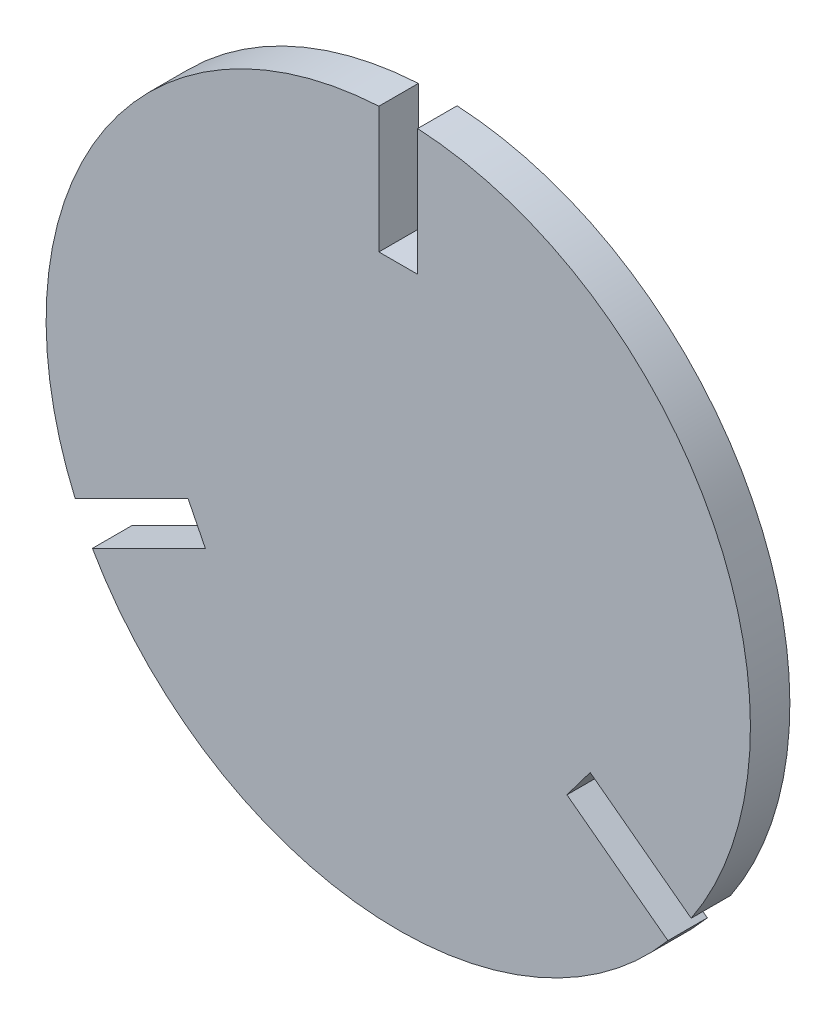
ISO-10303-21;
HEADER;
FILE_DESCRIPTION(('STEP AP214'),'2;1');
FILE_NAME('part.step','',(''),(''),'','','');
FILE_SCHEMA(('AUTOMOTIVE_DESIGN { 1 0 10303 214 1 1 1 1 }'));
ENDSEC;
DATA;
#1=APPLICATION_CONTEXT('core data for automotive mechanical design processes');
#2=APPLICATION_PROTOCOL_DEFINITION('international standard','automotive_design',2000,#1);
#3=PRODUCT_CONTEXT('',#1,'mechanical');
#4=PRODUCT('Part','Part','',(#3));
#5=PRODUCT_RELATED_PRODUCT_CATEGORY('part','',(#4));
#6=PRODUCT_DEFINITION_FORMATION('','',#4);
#7=PRODUCT_DEFINITION_CONTEXT('part definition',#1,'design');
#8=PRODUCT_DEFINITION('design','',#6,#7);
#9=PRODUCT_DEFINITION_SHAPE('','',#8);
#10=(LENGTH_UNIT() NAMED_UNIT(*) SI_UNIT(.MILLI.,.METRE.));
#11=(NAMED_UNIT(*) PLANE_ANGLE_UNIT() SI_UNIT($,.RADIAN.));
#12=(NAMED_UNIT(*) SI_UNIT($,.STERADIAN.) SOLID_ANGLE_UNIT());
#13=UNCERTAINTY_MEASURE_WITH_UNIT(LENGTH_MEASURE(1.E-05),#10,'distance_accuracy_value','');
#14=(GEOMETRIC_REPRESENTATION_CONTEXT(3) GLOBAL_UNCERTAINTY_ASSIGNED_CONTEXT((#13)) GLOBAL_UNIT_ASSIGNED_CONTEXT((#10,
#11,#12)) REPRESENTATION_CONTEXT('',''));
#15=CARTESIAN_POINT('',(0.,0.,0.));
#16=DIRECTION('',(0.,0.,1.));
#17=DIRECTION('',(1.,0.,0.));
#18=AXIS2_PLACEMENT_3D('',#15,#16,#17);
#19=CARTESIAN_POINT('',(0.,0.,2.8));
#20=DIRECTION('',(0.,0.,-1.));
#21=DIRECTION('',(-1.,0.,0.));
#22=AXIS2_PLACEMENT_3D('',#19,#20,#21);
#23=CYLINDRICAL_SURFACE('',#22,25.);
#24=DIRECTION('',(0.,0.,-1.));
#25=VECTOR('',#24,1.);
#26=CARTESIAN_POINT('',(-22.9426279770591,-9.93155685208841,2.8));
#27=LINE('',#26,#25);
#28=CARTESIAN_POINT('',(-22.9426279770591,-9.93155685208841,2.8));
#29=VERTEX_POINT('',#28);
#30=CARTESIAN_POINT('',(-22.9426279770591,-9.93155685208841,0.));
#31=VERTEX_POINT('',#30);
#32=EDGE_CURVE('E172',#29,#31,#27,.T.);
#33=ORIENTED_EDGE('',*,*,#32,.F.);
#34=CARTESIAN_POINT('',(0.,0.,2.8));
#35=DIRECTION('',(0.,0.,1.));
#36=DIRECTION('',(1.,0.,0.));
#37=AXIS2_PLACEMENT_3D('',#34,#35,#36);
#38=CIRCLE('',#37,25.);
#39=CARTESIAN_POINT('',(-1.375,24.9621588609639,2.8));
#40=VERTEX_POINT('',#39);
#41=EDGE_CURVE('E198',#40,#29,#38,.T.);
#42=ORIENTED_EDGE('',*,*,#41,.F.);
#43=DIRECTION('',(0.,0.,-1.));
#44=VECTOR('',#43,1.);
#45=CARTESIAN_POINT('',(-1.375,24.9621588609639,2.8));
#46=LINE('',#45,#44);
#47=CARTESIAN_POINT('',(-1.375,24.9621588609639,0.));
#48=VERTEX_POINT('',#47);
#49=EDGE_CURVE('E192',#48,#40,#46,.F.);
#50=ORIENTED_EDGE('',*,*,#49,.F.);
#51=CARTESIAN_POINT('',(0.,0.,0.));
#52=DIRECTION('',(0.,0.,1.));
#53=DIRECTION('',(1.,0.,0.));
#54=AXIS2_PLACEMENT_3D('',#51,#52,#53);
#55=CIRCLE('',#54,25.);
#56=EDGE_CURVE('E203',#48,#31,#55,.T.);
#57=ORIENTED_EDGE('',*,*,#56,.T.);
#58=EDGE_LOOP('',(#33,#42,#50,#57));
#59=FACE_BOUND('',#58,.T.);
#60=ADVANCED_FACE('F35',(#59),#23,.T.);
#61=DIRECTION('',(0.,0.,-1.));
#62=VECTOR('',#61,1.);
#63=CARTESIAN_POINT('',(-21.7130074383324,-12.3913400398392,2.8));
#64=LINE('',#63,#62);
#65=CARTESIAN_POINT('',(-21.7130074383324,-12.3913400398392,0.));
#66=VERTEX_POINT('',#65);
#67=CARTESIAN_POINT('',(-21.7130074383324,-12.3913400398392,2.8));
#68=VERTEX_POINT('',#67);
#69=EDGE_CURVE('E129',#66,#68,#64,.F.);
#70=ORIENTED_EDGE('',*,*,#69,.F.);
#71=CARTESIAN_POINT('',(19.1418920530605,-16.0806706523385,0.));
#72=VERTEX_POINT('',#71);
#73=EDGE_CURVE('E206',#66,#72,#55,.T.);
#74=ORIENTED_EDGE('',*,*,#73,.T.);
#75=DIRECTION('',(0.,0.,-1.));
#76=VECTOR('',#75,1.);
#77=CARTESIAN_POINT('',(19.1418920530605,-16.0806706523385,2.8));
#78=LINE('',#77,#76);
#79=CARTESIAN_POINT('',(19.1418920530605,-16.0806706523385,2.8));
#80=VERTEX_POINT('',#79);
#81=EDGE_CURVE('E169',#80,#72,#78,.T.);
#82=ORIENTED_EDGE('',*,*,#81,.F.);
#83=EDGE_CURVE('E201',#68,#80,#38,.T.);
#84=ORIENTED_EDGE('',*,*,#83,.F.);
#85=EDGE_LOOP('',(#70,#74,#82,#84));
#86=FACE_BOUND('',#85,.T.);
#87=ADVANCED_FACE('F225',(#86),#23,.T.);
#88=DIRECTION('',(0.,0.,-1.));
#89=VECTOR('',#88,1.);
#90=CARTESIAN_POINT('',(20.7922799299633,-13.880961613449,2.8));
#91=LINE('',#90,#89);
#92=CARTESIAN_POINT('',(20.7922799299633,-13.880961613449,0.));
#93=VERTEX_POINT('',#92);
#94=CARTESIAN_POINT('',(20.7922799299633,-13.880961613449,2.8));
#95=VERTEX_POINT('',#94);
#96=EDGE_CURVE('E142',#93,#95,#91,.F.);
#97=ORIENTED_EDGE('',*,*,#96,.F.);
#98=CARTESIAN_POINT('',(1.375,24.9621588609639,0.));
#99=VERTEX_POINT('',#98);
#100=EDGE_CURVE('E197',#93,#99,#55,.T.);
#101=ORIENTED_EDGE('',*,*,#100,.T.);
#102=DIRECTION('',(0.,0.,-1.));
#103=VECTOR('',#102,1.);
#104=CARTESIAN_POINT('',(1.375,24.9621588609639,2.8));
#105=LINE('',#104,#103);
#106=CARTESIAN_POINT('',(1.375,24.9621588609639,2.8));
#107=VERTEX_POINT('',#106);
#108=EDGE_CURVE('E194',#107,#99,#105,.T.);
#109=ORIENTED_EDGE('',*,*,#108,.F.);
#110=EDGE_CURVE('E202',#95,#107,#38,.T.);
#111=ORIENTED_EDGE('',*,*,#110,.F.);
#112=EDGE_LOOP('',(#97,#101,#109,#111));
#113=FACE_BOUND('',#112,.T.);
#114=ADVANCED_FACE('F218',(#113),#23,.T.);
#115=CARTESIAN_POINT('',(0.,0.,2.8));
#116=DIRECTION('',(0.,0.,1.));
#117=DIRECTION('',(1.,0.,0.));
#118=AXIS2_PLACEMENT_3D('',#115,#116,#117);
#119=PLANE('',#118);
#120=ORIENTED_EDGE('',*,*,#41,.T.);
#121=DIRECTION('',(-0.894466613727558,-0.447134741355171,0.));
#122=VECTOR('',#121,1.);
#123=CARTESIAN_POINT('',(-31.0266751361003,-13.9726896122004,2.8));
#124=LINE('',#123,#122);
#125=CARTESIAN_POINT('',(-14.9262760890043,-5.92426426780735,2.8));
#126=VERTEX_POINT('',#125);
#127=EDGE_CURVE('E135',#126,#29,#124,.T.);
#128=ORIENTED_EDGE('',*,*,#127,.F.);
#129=DIRECTION('',(-0.447134741355171,0.894466613727558,0.));
#130=VECTOR('',#129,1.);
#131=CARTESIAN_POINT('',(-13.6966555502776,-8.38404745555813,2.8));
#132=LINE('',#131,#130);
#133=CARTESIAN_POINT('',(-13.6966555502776,-8.38404745555813,2.8));
#134=VERTEX_POINT('',#133);
#135=EDGE_CURVE('E134',#134,#126,#132,.T.);
#136=ORIENTED_EDGE('',*,*,#135,.F.);
#137=DIRECTION('',(0.894466613727558,0.447134741355171,0.));
#138=VECTOR('',#137,1.);
#139=CARTESIAN_POINT('',(-29.7970545973736,-16.4324727999512,2.8));
#140=LINE('',#139,#138);
#141=EDGE_CURVE('E123',#68,#134,#140,.T.);
#142=ORIENTED_EDGE('',*,*,#141,.F.);
#143=ORIENTED_EDGE('',*,*,#83,.T.);
#144=DIRECTION('',(0.799894195959815,-0.600141046146488,0.));
#145=VECTOR('',#144,1.);
#146=CARTESIAN_POINT('',(26.3712087241823,-21.5046500884254,2.8));
#147=LINE('',#146,#145);
#148=CARTESIAN_POINT('',(11.9731131969056,-10.7021112577886,2.8));
#149=VERTEX_POINT('',#148);
#150=EDGE_CURVE('E155',#149,#80,#147,.T.);
#151=ORIENTED_EDGE('',*,*,#150,.F.);
#152=DIRECTION('',(-0.600141046146488,-0.799894195959815,0.));
#153=VECTOR('',#152,1.);
#154=CARTESIAN_POINT('',(13.6235010738085,-8.50240221889907,2.8));
#155=LINE('',#154,#153);
#156=CARTESIAN_POINT('',(13.6235010738085,-8.50240221889907,2.8));
#157=VERTEX_POINT('',#156);
#158=EDGE_CURVE('E160',#157,#149,#155,.T.);
#159=ORIENTED_EDGE('',*,*,#158,.F.);
#160=DIRECTION('',(-0.799894195959815,0.600141046146488,0.));
#161=VECTOR('',#160,1.);
#162=CARTESIAN_POINT('',(28.0215966010851,-19.3049410495359,2.8));
#163=LINE('',#162,#161);
#164=EDGE_CURVE('E157',#95,#157,#163,.T.);
#165=ORIENTED_EDGE('',*,*,#164,.F.);
#166=ORIENTED_EDGE('',*,*,#110,.T.);
#167=DIRECTION('',(0.,1.,0.));
#168=VECTOR('',#167,1.);
#169=CARTESIAN_POINT('',(1.375,34.,2.8));
#170=LINE('',#169,#168);
#171=CARTESIAN_POINT('',(1.375,16.,2.8));
#172=VERTEX_POINT('',#171);
#173=EDGE_CURVE('E175',#172,#107,#170,.T.);
#174=ORIENTED_EDGE('',*,*,#173,.F.);
#175=DIRECTION('',(1.,0.,0.));
#176=VECTOR('',#175,1.);
#177=CARTESIAN_POINT('',(-1.375,16.,2.8));
#178=LINE('',#177,#176);
#179=CARTESIAN_POINT('',(-1.375,16.,2.8));
#180=VERTEX_POINT('',#179);
#181=EDGE_CURVE('E181',#180,#172,#178,.T.);
#182=ORIENTED_EDGE('',*,*,#181,.F.);
#183=DIRECTION('',(0.,-1.,0.));
#184=VECTOR('',#183,1.);
#185=CARTESIAN_POINT('',(-1.375,34.,2.8));
#186=LINE('',#185,#184);
#187=EDGE_CURVE('E178',#40,#180,#186,.T.);
#188=ORIENTED_EDGE('',*,*,#187,.F.);
#189=EDGE_LOOP('',(#120,#128,#136,#142,#143,#151,#159,#165,#166,#174,#182,#188));
#190=FACE_BOUND('',#189,.T.);
#191=ADVANCED_FACE('F147',(#190),#119,.T.);
#192=CARTESIAN_POINT('',(0.,0.,0.));
#193=DIRECTION('',(0.,0.,1.));
#194=DIRECTION('',(1.,0.,0.));
#195=AXIS2_PLACEMENT_3D('',#192,#193,#194);
#196=PLANE('',#195);
#197=DIRECTION('',(-0.894466613727558,-0.447134741355171,0.));
#198=VECTOR('',#197,1.);
#199=CARTESIAN_POINT('',(-31.0266751361003,-13.9726896122004,0.));
#200=LINE('',#199,#198);
#201=CARTESIAN_POINT('',(-14.9262760890043,-5.92426426780735,0.));
#202=VERTEX_POINT('',#201);
#203=EDGE_CURVE('E49',#202,#31,#200,.T.);
#204=ORIENTED_EDGE('',*,*,#203,.T.);
#205=ORIENTED_EDGE('',*,*,#56,.F.);
#206=DIRECTION('',(0.,1.,0.));
#207=VECTOR('',#206,1.);
#208=CARTESIAN_POINT('',(-1.375,0.,0.));
#209=LINE('',#208,#207);
#210=CARTESIAN_POINT('',(-1.375,16.,0.));
#211=VERTEX_POINT('',#210);
#212=EDGE_CURVE('E200',#211,#48,#209,.T.);
#213=ORIENTED_EDGE('',*,*,#212,.F.);
#214=DIRECTION('',(1.,0.,0.));
#215=VECTOR('',#214,1.);
#216=CARTESIAN_POINT('',(-1.375,16.,0.));
#217=LINE('',#216,#215);
#218=CARTESIAN_POINT('',(1.375,16.,0.));
#219=VERTEX_POINT('',#218);
#220=EDGE_CURVE('E179',#211,#219,#217,.T.);
#221=ORIENTED_EDGE('',*,*,#220,.T.);
#222=DIRECTION('',(0.,1.,0.));
#223=VECTOR('',#222,1.);
#224=CARTESIAN_POINT('',(1.375,34.,0.));
#225=LINE('',#224,#223);
#226=EDGE_CURVE('E174',#219,#99,#225,.T.);
#227=ORIENTED_EDGE('',*,*,#226,.T.);
#228=ORIENTED_EDGE('',*,*,#100,.F.);
#229=DIRECTION('',(0.799894195959815,-0.600141046146488,0.));
#230=VECTOR('',#229,1.);
#231=CARTESIAN_POINT('',(0.825193938451419,1.09985451944474,0.));
#232=LINE('',#231,#230);
#233=CARTESIAN_POINT('',(13.6235010738085,-8.50240221889907,0.));
#234=VERTEX_POINT('',#233);
#235=EDGE_CURVE('E42',#234,#93,#232,.T.);
#236=ORIENTED_EDGE('',*,*,#235,.F.);
#237=DIRECTION('',(-0.600141046146488,-0.799894195959815,0.));
#238=VECTOR('',#237,1.);
#239=CARTESIAN_POINT('',(13.6235010738085,-8.50240221889907,0.));
#240=LINE('',#239,#238);
#241=CARTESIAN_POINT('',(11.9731131969056,-10.7021112577886,0.));
#242=VERTEX_POINT('',#241);
#243=EDGE_CURVE('E158',#234,#242,#240,.T.);
#244=ORIENTED_EDGE('',*,*,#243,.T.);
#245=DIRECTION('',(0.799894195959815,-0.600141046146488,0.));
#246=VECTOR('',#245,1.);
#247=CARTESIAN_POINT('',(26.3712087241823,-21.5046500884254,0.));
#248=LINE('',#247,#246);
#249=EDGE_CURVE('E57',#242,#72,#248,.T.);
#250=ORIENTED_EDGE('',*,*,#249,.T.);
#251=ORIENTED_EDGE('',*,*,#73,.F.);
#252=DIRECTION('',(-0.894466613727558,-0.447134741355171,0.));
#253=VECTOR('',#252,1.);
#254=CARTESIAN_POINT('',(0.61481026936336,-1.22989159387539,0.));
#255=LINE('',#254,#253);
#256=CARTESIAN_POINT('',(-13.6966555502776,-8.38404745555813,0.));
#257=VERTEX_POINT('',#256);
#258=EDGE_CURVE('E11',#257,#66,#255,.T.);
#259=ORIENTED_EDGE('',*,*,#258,.F.);
#260=DIRECTION('',(-0.447134741355171,0.894466613727558,0.));
#261=VECTOR('',#260,1.);
#262=CARTESIAN_POINT('',(-13.6966555502776,-8.38404745555813,0.));
#263=LINE('',#262,#261);
#264=EDGE_CURVE('E140',#257,#202,#263,.T.);
#265=ORIENTED_EDGE('',*,*,#264,.T.);
#266=EDGE_LOOP('',(#204,#205,#213,#221,#227,#228,#236,#244,#250,#251,#259,#265));
#267=FACE_BOUND('',#266,.T.);
#268=ADVANCED_FACE('F220',(#267),#196,.F.);
#269=CARTESIAN_POINT('',(1.375,34.,2.8));
#270=DIRECTION('',(-1.,0.,0.));
#271=DIRECTION('',(0.,-1.,0.));
#272=AXIS2_PLACEMENT_3D('',#269,#270,#271);
#273=PLANE('',#272);
#274=ORIENTED_EDGE('',*,*,#108,.T.);
#275=ORIENTED_EDGE('',*,*,#226,.F.);
#276=DIRECTION('',(0.,0.,-1.));
#277=VECTOR('',#276,1.);
#278=CARTESIAN_POINT('',(1.375,16.,2.8));
#279=LINE('',#278,#277);
#280=EDGE_CURVE('E183',#172,#219,#279,.T.);
#281=ORIENTED_EDGE('',*,*,#280,.F.);
#282=ORIENTED_EDGE('',*,*,#173,.T.);
#283=EDGE_LOOP('',(#274,#275,#281,#282));
#284=FACE_BOUND('',#283,.T.);
#285=ADVANCED_FACE('F235',(#284),#273,.T.);
#286=CARTESIAN_POINT('',(-1.375,34.,2.8));
#287=DIRECTION('',(1.,0.,0.));
#288=DIRECTION('',(0.,1.,0.));
#289=AXIS2_PLACEMENT_3D('',#286,#287,#288);
#290=PLANE('',#289);
#291=ORIENTED_EDGE('',*,*,#49,.T.);
#292=ORIENTED_EDGE('',*,*,#187,.T.);
#293=DIRECTION('',(0.,0.,-1.));
#294=VECTOR('',#293,1.);
#295=CARTESIAN_POINT('',(-1.375,16.,2.8));
#296=LINE('',#295,#294);
#297=EDGE_CURVE('E190',#180,#211,#296,.T.);
#298=ORIENTED_EDGE('',*,*,#297,.T.);
#299=ORIENTED_EDGE('',*,*,#212,.T.);
#300=EDGE_LOOP('',(#291,#292,#298,#299));
#301=FACE_BOUND('',#300,.T.);
#302=ADVANCED_FACE('F244',(#301),#290,.T.);
#303=CARTESIAN_POINT('',(-1.375,16.,2.8));
#304=DIRECTION('',(0.,1.,0.));
#305=DIRECTION('',(0.,0.,1.));
#306=AXIS2_PLACEMENT_3D('',#303,#304,#305);
#307=PLANE('',#306);
#308=ORIENTED_EDGE('',*,*,#220,.F.);
#309=ORIENTED_EDGE('',*,*,#297,.F.);
#310=ORIENTED_EDGE('',*,*,#181,.T.);
#311=ORIENTED_EDGE('',*,*,#280,.T.);
#312=EDGE_LOOP('',(#308,#309,#310,#311));
#313=FACE_BOUND('',#312,.T.);
#314=ADVANCED_FACE('F238',(#313),#307,.T.);
#315=CARTESIAN_POINT('',(26.3712087241823,-21.5046500884254,2.8));
#316=DIRECTION('',(0.600141046146488,0.799894195959815,0.));
#317=DIRECTION('',(-0.799894195959815,0.600141046146488,0.));
#318=AXIS2_PLACEMENT_3D('',#315,#316,#317);
#319=PLANE('',#318);
#320=ORIENTED_EDGE('',*,*,#81,.T.);
#321=ORIENTED_EDGE('',*,*,#249,.F.);
#322=DIRECTION('',(0.,0.,-1.));
#323=VECTOR('',#322,1.);
#324=CARTESIAN_POINT('',(11.9731131969056,-10.7021112577886,2.8));
#325=LINE('',#324,#323);
#326=EDGE_CURVE('E162',#149,#242,#325,.T.);
#327=ORIENTED_EDGE('',*,*,#326,.F.);
#328=ORIENTED_EDGE('',*,*,#150,.T.);
#329=EDGE_LOOP('',(#320,#321,#327,#328));
#330=FACE_BOUND('',#329,.T.);
#331=ADVANCED_FACE('F230',(#330),#319,.T.);
#332=CARTESIAN_POINT('',(28.0215966010851,-19.3049410495359,2.8));
#333=DIRECTION('',(-0.600141046146488,-0.799894195959815,0.));
#334=DIRECTION('',(0.799894195959815,-0.600141046146488,0.));
#335=AXIS2_PLACEMENT_3D('',#332,#333,#334);
#336=PLANE('',#335);
#337=ORIENTED_EDGE('',*,*,#96,.T.);
#338=ORIENTED_EDGE('',*,*,#164,.T.);
#339=DIRECTION('',(0.,0.,-1.));
#340=VECTOR('',#339,1.);
#341=CARTESIAN_POINT('',(13.6235010738085,-8.50240221889907,2.8));
#342=LINE('',#341,#340);
#343=EDGE_CURVE('E153',#157,#234,#342,.T.);
#344=ORIENTED_EDGE('',*,*,#343,.T.);
#345=ORIENTED_EDGE('',*,*,#235,.T.);
#346=EDGE_LOOP('',(#337,#338,#344,#345));
#347=FACE_BOUND('',#346,.T.);
#348=ADVANCED_FACE('F210',(#347),#336,.T.);
#349=CARTESIAN_POINT('',(13.6235010738085,-8.50240221889907,2.8));
#350=DIRECTION('',(0.799894195959815,-0.600141046146488,0.));
#351=DIRECTION('',(0.600141046146488,0.799894195959815,0.));
#352=AXIS2_PLACEMENT_3D('',#349,#350,#351);
#353=PLANE('',#352);
#354=ORIENTED_EDGE('',*,*,#243,.F.);
#355=ORIENTED_EDGE('',*,*,#343,.F.);
#356=ORIENTED_EDGE('',*,*,#158,.T.);
#357=ORIENTED_EDGE('',*,*,#326,.T.);
#358=EDGE_LOOP('',(#354,#355,#356,#357));
#359=FACE_BOUND('',#358,.T.);
#360=ADVANCED_FACE('F227',(#359),#353,.T.);
#361=CARTESIAN_POINT('',(-31.0266751361003,-13.9726896122004,2.8));
#362=DIRECTION('',(0.447134741355171,-0.894466613727558,0.));
#363=DIRECTION('',(0.894466613727558,0.447134741355171,0.));
#364=AXIS2_PLACEMENT_3D('',#361,#362,#363);
#365=PLANE('',#364);
#366=ORIENTED_EDGE('',*,*,#32,.T.);
#367=ORIENTED_EDGE('',*,*,#203,.F.);
#368=DIRECTION('',(0.,0.,-1.));
#369=VECTOR('',#368,1.);
#370=CARTESIAN_POINT('',(-14.9262760890043,-5.92426426780735,2.8));
#371=LINE('',#370,#369);
#372=EDGE_CURVE('E143',#126,#202,#371,.T.);
#373=ORIENTED_EDGE('',*,*,#372,.F.);
#374=ORIENTED_EDGE('',*,*,#127,.T.);
#375=EDGE_LOOP('',(#366,#367,#373,#374));
#376=FACE_BOUND('',#375,.T.);
#377=ADVANCED_FACE('F249',(#376),#365,.T.);
#378=CARTESIAN_POINT('',(-29.7970545973736,-16.4324727999512,2.8));
#379=DIRECTION('',(-0.447134741355171,0.894466613727558,0.));
#380=DIRECTION('',(-0.894466613727558,-0.447134741355171,0.));
#381=AXIS2_PLACEMENT_3D('',#378,#379,#380);
#382=PLANE('',#381);
#383=ORIENTED_EDGE('',*,*,#69,.T.);
#384=ORIENTED_EDGE('',*,*,#141,.T.);
#385=DIRECTION('',(0.,0.,-1.));
#386=VECTOR('',#385,1.);
#387=CARTESIAN_POINT('',(-13.6966555502776,-8.38404745555813,2.8));
#388=LINE('',#387,#386);
#389=EDGE_CURVE('E126',#134,#257,#388,.T.);
#390=ORIENTED_EDGE('',*,*,#389,.T.);
#391=ORIENTED_EDGE('',*,*,#258,.T.);
#392=EDGE_LOOP('',(#383,#384,#390,#391));
#393=FACE_BOUND('',#392,.T.);
#394=ADVANCED_FACE('F125',(#393),#382,.T.);
#395=CARTESIAN_POINT('',(-13.6966555502776,-8.38404745555813,2.8));
#396=DIRECTION('',(-0.894466613727558,-0.447134741355171,0.));
#397=DIRECTION('',(0.447134741355171,-0.894466613727558,0.));
#398=AXIS2_PLACEMENT_3D('',#395,#396,#397);
#399=PLANE('',#398);
#400=ORIENTED_EDGE('',*,*,#264,.F.);
#401=ORIENTED_EDGE('',*,*,#389,.F.);
#402=ORIENTED_EDGE('',*,*,#135,.T.);
#403=ORIENTED_EDGE('',*,*,#372,.T.);
#404=EDGE_LOOP('',(#400,#401,#402,#403));
#405=FACE_BOUND('',#404,.T.);
#406=ADVANCED_FACE('F138',(#405),#399,.T.);
#407=CLOSED_SHELL('',(#60,#87,#114,#191,#268,#285,#302,#314,#331,#348,#360,#377,#394,#406));
#408=MANIFOLD_SOLID_BREP('B2',#407);
#409=ADVANCED_BREP_SHAPE_REPRESENTATION('',(#18,#408),#14);
#410=SHAPE_DEFINITION_REPRESENTATION(#9,#409);
ENDSEC;
END-ISO-10303-21;
